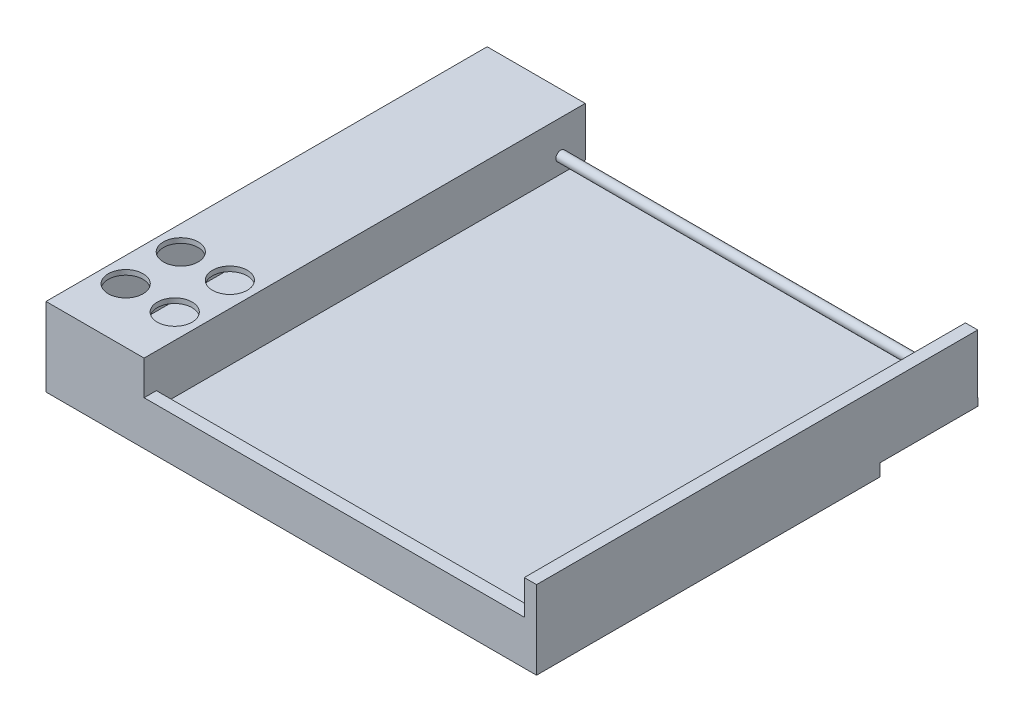
ISO-10303-21;
HEADER;
FILE_DESCRIPTION(('STEP AP214'),'2;1');
FILE_NAME('part.step','',(''),(''),'','','');
FILE_SCHEMA(('AUTOMOTIVE_DESIGN { 1 0 10303 214 1 1 1 1 }'));
ENDSEC;
DATA;
#1=APPLICATION_CONTEXT('core data for automotive mechanical design processes');
#2=APPLICATION_PROTOCOL_DEFINITION('international standard','automotive_design',2000,#1);
#3=PRODUCT_CONTEXT('',#1,'mechanical');
#4=PRODUCT('Part','Part','',(#3));
#5=PRODUCT_RELATED_PRODUCT_CATEGORY('part','',(#4));
#6=PRODUCT_DEFINITION_FORMATION('','',#4);
#7=PRODUCT_DEFINITION_CONTEXT('part definition',#1,'design');
#8=PRODUCT_DEFINITION('design','',#6,#7);
#9=PRODUCT_DEFINITION_SHAPE('','',#8);
#10=(LENGTH_UNIT() NAMED_UNIT(*) SI_UNIT(.MILLI.,.METRE.));
#11=(NAMED_UNIT(*) PLANE_ANGLE_UNIT() SI_UNIT($,.RADIAN.));
#12=(NAMED_UNIT(*) SI_UNIT($,.STERADIAN.) SOLID_ANGLE_UNIT());
#13=UNCERTAINTY_MEASURE_WITH_UNIT(LENGTH_MEASURE(1.E-05),#10,'distance_accuracy_value','');
#14=(GEOMETRIC_REPRESENTATION_CONTEXT(3) GLOBAL_UNCERTAINTY_ASSIGNED_CONTEXT((#13)) GLOBAL_UNIT_ASSIGNED_CONTEXT((#10,
#11,#12)) REPRESENTATION_CONTEXT('',''));
#15=CARTESIAN_POINT('',(0.,0.,0.));
#16=DIRECTION('',(0.,0.,1.));
#17=DIRECTION('',(1.,0.,0.));
#18=AXIS2_PLACEMENT_3D('',#15,#16,#17);
#19=CARTESIAN_POINT('',(0.,3.,0.));
#20=DIRECTION('',(0.,-1.,0.));
#21=DIRECTION('',(0.,0.,-1.));
#22=AXIS2_PLACEMENT_3D('',#19,#20,#21);
#23=PLANE('',#22);
#24=DIRECTION('',(-1.,0.,0.));
#25=VECTOR('',#24,1.);
#26=CARTESIAN_POINT('',(-59.9999999999998,3.,84.9999999999995));
#27=LINE('',#26,#25);
#28=CARTESIAN_POINT('',(95.0000000000002,3.,84.9999999999995));
#29=VERTEX_POINT('',#28);
#30=CARTESIAN_POINT('',(-97.9999999999998,3.,84.9999999999995));
#31=VERTEX_POINT('',#30);
#32=EDGE_CURVE('E323',#29,#31,#27,.T.);
#33=ORIENTED_EDGE('',*,*,#32,.F.);
#34=DIRECTION('',(0.,0.,-1.));
#35=VECTOR('',#34,1.);
#36=CARTESIAN_POINT('',(95.0000000000002,3.,246.847059264749));
#37=LINE('',#36,#35);
#38=CARTESIAN_POINT('',(95.0000000000002,3.,-89.8697054914942));
#39=VERTEX_POINT('',#38);
#40=EDGE_CURVE('E300',#29,#39,#37,.T.);
#41=ORIENTED_EDGE('',*,*,#40,.T.);
#42=DIRECTION('',(-1.,0.,0.));
#43=VECTOR('',#42,1.);
#44=CARTESIAN_POINT('',(-99.9999999999998,3.,-89.8697054914942));
#45=LINE('',#44,#43);
#46=CARTESIAN_POINT('',(100.,3.,-89.8697054914941));
#47=VERTEX_POINT('',#46);
#48=EDGE_CURVE('E203',#47,#39,#45,.T.);
#49=ORIENTED_EDGE('',*,*,#48,.F.);
#50=DIRECTION('',(0.,0.,-1.));
#51=VECTOR('',#50,1.);
#52=CARTESIAN_POINT('',(100.,3.,89.9999999999995));
#53=LINE('',#52,#51);
#54=CARTESIAN_POINT('',(100.,3.,-90.0000000000004));
#55=VERTEX_POINT('',#54);
#56=EDGE_CURVE('E251',#47,#55,#53,.T.);
#57=ORIENTED_EDGE('',*,*,#56,.T.);
#58=DIRECTION('',(-1.,0.,0.));
#59=VECTOR('',#58,1.);
#60=CARTESIAN_POINT('',(-99.9999999999998,3.,-90.0000000000004));
#61=LINE('',#60,#59);
#62=CARTESIAN_POINT('',(-99.9999999999998,3.,-90.0000000000004));
#63=VERTEX_POINT('',#62);
#64=EDGE_CURVE('E254',#55,#63,#61,.T.);
#65=ORIENTED_EDGE('',*,*,#64,.T.);
#66=DIRECTION('',(0.,0.,1.));
#67=VECTOR('',#66,1.);
#68=CARTESIAN_POINT('',(-99.9999999999998,3.,89.9999999999995));
#69=LINE('',#68,#67);
#70=CARTESIAN_POINT('',(-99.9999999999998,3.,-89.8697054914942));
#71=VERTEX_POINT('',#70);
#72=EDGE_CURVE('E200',#63,#71,#69,.T.);
#73=ORIENTED_EDGE('',*,*,#72,.T.);
#74=CARTESIAN_POINT('',(-97.9999999999998,3.,-89.8697054914942));
#75=VERTEX_POINT('',#74);
#76=EDGE_CURVE('E191',#75,#71,#45,.T.);
#77=ORIENTED_EDGE('',*,*,#76,.F.);
#78=DIRECTION('',(0.,0.,-1.));
#79=VECTOR('',#78,1.);
#80=CARTESIAN_POINT('',(-97.9999999999998,3.,133.9089968002));
#81=LINE('',#80,#79);
#82=EDGE_CURVE('E173',#31,#75,#81,.T.);
#83=ORIENTED_EDGE('',*,*,#82,.F.);
#84=EDGE_LOOP('',(#33,#41,#49,#57,#65,#73,#77,#83));
#85=FACE_BOUND('',#84,.T.);
#86=ADVANCED_FACE('F45',(#85),#23,.F.);
#87=CARTESIAN_POINT('',(-59.9999999999998,3.,246.847059264749));
#88=DIRECTION('',(-1.,0.,0.));
#89=DIRECTION('',(0.,0.,1.));
#90=AXIS2_PLACEMENT_3D('',#87,#88,#89);
#91=PLANE('',#90);
#92=CARTESIAN_POINT('',(-59.9999999999998,13.5,-79.8697054914942));
#93=DIRECTION('',(-1.,0.,0.));
#94=DIRECTION('',(0.,0.,1.));
#95=AXIS2_PLACEMENT_3D('',#92,#93,#94);
#96=CIRCLE('',#95,2.);
#97=CARTESIAN_POINT('',(-59.9999999999998,13.5,-77.8697054914942));
#98=VERTEX_POINT('',#97);
#99=EDGE_CURVE('E12',#98,#98,#96,.F.);
#100=ORIENTED_EDGE('',*,*,#99,.F.);
#101=EDGE_LOOP('',(#100));
#102=FACE_BOUND('',#101,.T.);
#103=DIRECTION('',(0.,-1.,0.));
#104=VECTOR('',#103,1.);
#105=CARTESIAN_POINT('',(-59.9999999999998,13.,84.9999999999995));
#106=LINE('',#105,#104);
#107=CARTESIAN_POINT('',(-59.9999999999998,13.,84.9999999999995));
#108=VERTEX_POINT('',#107);
#109=CARTESIAN_POINT('',(-59.9999999999998,7.,84.9999999999995));
#110=VERTEX_POINT('',#109);
#111=EDGE_CURVE('E305',#108,#110,#106,.T.);
#112=ORIENTED_EDGE('',*,*,#111,.T.);
#113=DIRECTION('',(0.,0.,-1.));
#114=VECTOR('',#113,1.);
#115=CARTESIAN_POINT('',(-59.9999999999998,7.,133.9089968002));
#116=LINE('',#115,#114);
#117=CARTESIAN_POINT('',(-59.9999999999998,7.,-89.8697054914942));
#118=VERTEX_POINT('',#117);
#119=EDGE_CURVE('E61',#110,#118,#116,.T.);
#120=ORIENTED_EDGE('',*,*,#119,.T.);
#121=DIRECTION('',(0.,1.,0.));
#122=VECTOR('',#121,1.);
#123=CARTESIAN_POINT('',(-59.9999999999998,3.,-89.8697054914942));
#124=LINE('',#123,#122);
#125=CARTESIAN_POINT('',(-59.9999999999998,27.,-89.8697054914942));
#126=VERTEX_POINT('',#125);
#127=EDGE_CURVE('E304',#118,#126,#124,.T.);
#128=ORIENTED_EDGE('',*,*,#127,.T.);
#129=DIRECTION('',(0.,0.,-1.));
#130=VECTOR('',#129,1.);
#131=CARTESIAN_POINT('',(-59.9999999999998,27.,246.847059264749));
#132=LINE('',#131,#130);
#133=CARTESIAN_POINT('',(-59.9999999999998,27.,89.9999999999995));
#134=VERTEX_POINT('',#133);
#135=EDGE_CURVE('E334',#134,#126,#132,.T.);
#136=ORIENTED_EDGE('',*,*,#135,.F.);
#137=DIRECTION('',(0.,-1.,0.));
#138=VECTOR('',#137,1.);
#139=CARTESIAN_POINT('',(-59.9999999999998,3.,89.9999999999995));
#140=LINE('',#139,#138);
#141=CARTESIAN_POINT('',(-59.9999999999998,13.,89.9999999999995));
#142=VERTEX_POINT('',#141);
#143=EDGE_CURVE('E204',#134,#142,#140,.T.);
#144=ORIENTED_EDGE('',*,*,#143,.T.);
#145=DIRECTION('',(0.,0.,1.));
#146=VECTOR('',#145,1.);
#147=CARTESIAN_POINT('',(-59.9999999999998,13.,89.9999999999995));
#148=LINE('',#147,#146);
#149=EDGE_CURVE('E69',#108,#142,#148,.T.);
#150=ORIENTED_EDGE('',*,*,#149,.F.);
#151=EDGE_LOOP('',(#112,#120,#128,#136,#144,#150));
#152=FACE_BOUND('',#151,.T.);
#153=ADVANCED_FACE('F291',(#102,#152),#91,.F.);
#154=CARTESIAN_POINT('',(95.0000000000002,3.,246.847059264749));
#155=DIRECTION('',(1.,0.,0.));
#156=DIRECTION('',(0.,0.,-1.));
#157=AXIS2_PLACEMENT_3D('',#154,#155,#156);
#158=PLANE('',#157);
#159=CARTESIAN_POINT('',(95.0000000000002,13.5,-79.8697054914942));
#160=DIRECTION('',(1.,0.,0.));
#161=DIRECTION('',(0.,0.,-1.));
#162=AXIS2_PLACEMENT_3D('',#159,#160,#161);
#163=CIRCLE('',#162,2.);
#164=CARTESIAN_POINT('',(95.0000000000002,13.5,-81.8697054914942));
#165=VERTEX_POINT('',#164);
#166=EDGE_CURVE('E54',#165,#165,#163,.F.);
#167=ORIENTED_EDGE('',*,*,#166,.F.);
#168=EDGE_LOOP('',(#167));
#169=FACE_BOUND('',#168,.T.);
#170=DIRECTION('',(0.,-1.,0.));
#171=VECTOR('',#170,1.);
#172=CARTESIAN_POINT('',(95.0000000000002,13.,84.9999999999995));
#173=LINE('',#172,#171);
#174=CARTESIAN_POINT('',(95.0000000000002,13.,84.9999999999995));
#175=VERTEX_POINT('',#174);
#176=EDGE_CURVE('E295',#175,#29,#173,.T.);
#177=ORIENTED_EDGE('',*,*,#176,.F.);
#178=DIRECTION('',(0.,0.,-1.));
#179=VECTOR('',#178,1.);
#180=CARTESIAN_POINT('',(95.0000000000002,13.,89.9999999999995));
#181=LINE('',#180,#179);
#182=CARTESIAN_POINT('',(95.0000000000002,13.,89.9999999999995));
#183=VERTEX_POINT('',#182);
#184=EDGE_CURVE('E297',#183,#175,#181,.T.);
#185=ORIENTED_EDGE('',*,*,#184,.F.);
#186=DIRECTION('',(0.,1.,0.));
#187=VECTOR('',#186,1.);
#188=CARTESIAN_POINT('',(95.0000000000002,3.,89.9999999999995));
#189=LINE('',#188,#187);
#190=CARTESIAN_POINT('',(95.0000000000002,27.,89.9999999999995));
#191=VERTEX_POINT('',#190);
#192=EDGE_CURVE('E210',#183,#191,#189,.T.);
#193=ORIENTED_EDGE('',*,*,#192,.T.);
#194=DIRECTION('',(0.,0.,-1.));
#195=VECTOR('',#194,1.);
#196=CARTESIAN_POINT('',(95.0000000000002,27.,246.847059264749));
#197=LINE('',#196,#195);
#198=CARTESIAN_POINT('',(95.0000000000002,27.,-89.8697054914942));
#199=VERTEX_POINT('',#198);
#200=EDGE_CURVE('E337',#191,#199,#197,.T.);
#201=ORIENTED_EDGE('',*,*,#200,.T.);
#202=DIRECTION('',(0.,-1.,0.));
#203=VECTOR('',#202,1.);
#204=CARTESIAN_POINT('',(95.0000000000002,3.,-89.8697054914942));
#205=LINE('',#204,#203);
#206=EDGE_CURVE('E331',#199,#39,#205,.T.);
#207=ORIENTED_EDGE('',*,*,#206,.T.);
#208=ORIENTED_EDGE('',*,*,#40,.F.);
#209=EDGE_LOOP('',(#177,#185,#193,#201,#207,#208));
#210=FACE_BOUND('',#209,.T.);
#211=ADVANCED_FACE('F288',(#169,#210),#158,.F.);
#212=CARTESIAN_POINT('',(-99.9999999999998,27.,-89.8697054914942));
#213=DIRECTION('',(0.,0.,1.));
#214=DIRECTION('',(1.,0.,0.));
#215=AXIS2_PLACEMENT_3D('',#212,#213,#214);
#216=PLANE('',#215);
#217=ORIENTED_EDGE('',*,*,#127,.F.);
#218=DIRECTION('',(1.,0.,0.));
#219=VECTOR('',#218,1.);
#220=CARTESIAN_POINT('',(-61.9999999999998,7.,-89.8697054914942));
#221=LINE('',#220,#219);
#222=CARTESIAN_POINT('',(-61.9999999999998,7.,-89.8697054914942));
#223=VERTEX_POINT('',#222);
#224=EDGE_CURVE('E185',#223,#118,#221,.T.);
#225=ORIENTED_EDGE('',*,*,#224,.F.);
#226=DIRECTION('',(0.,-1.,0.));
#227=VECTOR('',#226,1.);
#228=CARTESIAN_POINT('',(-61.9999999999998,25.,-89.8697054914942));
#229=LINE('',#228,#227);
#230=CARTESIAN_POINT('',(-61.9999999999998,25.,-89.8697054914942));
#231=VERTEX_POINT('',#230);
#232=EDGE_CURVE('E505',#231,#223,#229,.T.);
#233=ORIENTED_EDGE('',*,*,#232,.F.);
#234=DIRECTION('',(1.,0.,0.));
#235=VECTOR('',#234,1.);
#236=CARTESIAN_POINT('',(-97.9999999999998,25.,-89.8697054914942));
#237=LINE('',#236,#235);
#238=CARTESIAN_POINT('',(-97.9999999999998,25.,-89.8697054914942));
#239=VERTEX_POINT('',#238);
#240=EDGE_CURVE('E195',#239,#231,#237,.T.);
#241=ORIENTED_EDGE('',*,*,#240,.F.);
#242=DIRECTION('',(0.,1.,0.));
#243=VECTOR('',#242,1.);
#244=CARTESIAN_POINT('',(-97.9999999999998,3.,-89.8697054914942));
#245=LINE('',#244,#243);
#246=EDGE_CURVE('E177',#75,#239,#245,.T.);
#247=ORIENTED_EDGE('',*,*,#246,.F.);
#248=ORIENTED_EDGE('',*,*,#76,.T.);
#249=DIRECTION('',(0.,-1.,0.));
#250=VECTOR('',#249,1.);
#251=CARTESIAN_POINT('',(-99.9999999999998,27.,-89.8697054914942));
#252=LINE('',#251,#250);
#253=CARTESIAN_POINT('',(-99.9999999999998,27.,-89.8697054914942));
#254=VERTEX_POINT('',#253);
#255=EDGE_CURVE('E216',#254,#71,#252,.T.);
#256=ORIENTED_EDGE('',*,*,#255,.F.);
#257=DIRECTION('',(-1.,0.,0.));
#258=VECTOR('',#257,1.);
#259=CARTESIAN_POINT('',(-99.9999999999998,27.,-89.8697054914942));
#260=LINE('',#259,#258);
#261=EDGE_CURVE('E352',#126,#254,#260,.T.);
#262=ORIENTED_EDGE('',*,*,#261,.F.);
#263=EDGE_LOOP('',(#217,#225,#233,#241,#247,#248,#256,#262));
#264=FACE_BOUND('',#263,.T.);
#265=ADVANCED_FACE('F189',(#264),#216,.F.);
#266=CARTESIAN_POINT('',(0.,27.,0.));
#267=DIRECTION('',(0.,-1.,0.));
#268=DIRECTION('',(0.,0.,-1.));
#269=AXIS2_PLACEMENT_3D('',#266,#267,#268);
#270=PLANE('',#269);
#271=CARTESIAN_POINT('',(-89.9999999999998,27.,45.0325736271261));
#272=DIRECTION('',(0.,1.,0.));
#273=DIRECTION('',(0.,0.,-1.));
#274=AXIS2_PLACEMENT_3D('',#271,#272,#273);
#275=CIRCLE('',#274,7.1);
#276=CARTESIAN_POINT('',(-89.9999999999998,27.,37.9325736271261));
#277=VERTEX_POINT('',#276);
#278=EDGE_CURVE('E479',#277,#277,#275,.T.);
#279=ORIENTED_EDGE('',*,*,#278,.F.);
#280=EDGE_LOOP('',(#279));
#281=FACE_BOUND('',#280,.T.);
#282=CARTESIAN_POINT('',(-89.9999999999998,27.,67.516286813563));
#283=DIRECTION('',(0.,1.,0.));
#284=DIRECTION('',(0.,0.,-1.));
#285=AXIS2_PLACEMENT_3D('',#282,#283,#284);
#286=CIRCLE('',#285,7.09999999999999);
#287=CARTESIAN_POINT('',(-89.9999999999998,27.,60.416286813563));
#288=VERTEX_POINT('',#287);
#289=EDGE_CURVE('E472',#288,#288,#286,.T.);
#290=ORIENTED_EDGE('',*,*,#289,.F.);
#291=EDGE_LOOP('',(#290));
#292=FACE_BOUND('',#291,.T.);
#293=CARTESIAN_POINT('',(-69.9999999999998,27.,67.516286813563));
#294=DIRECTION('',(0.,1.,0.));
#295=DIRECTION('',(0.,0.,1.));
#296=AXIS2_PLACEMENT_3D('',#293,#294,#295);
#297=CIRCLE('',#296,7.09999999999999);
#298=CARTESIAN_POINT('',(-69.9999999999998,27.,74.616286813563));
#299=VERTEX_POINT('',#298);
#300=EDGE_CURVE('E463',#299,#299,#297,.T.);
#301=ORIENTED_EDGE('',*,*,#300,.F.);
#302=EDGE_LOOP('',(#301));
#303=FACE_BOUND('',#302,.T.);
#304=CARTESIAN_POINT('',(-69.9999999999998,27.,45.0325736271261));
#305=DIRECTION('',(0.,1.,0.));
#306=DIRECTION('',(0.,0.,1.));
#307=AXIS2_PLACEMENT_3D('',#304,#305,#306);
#308=CIRCLE('',#307,7.1);
#309=CARTESIAN_POINT('',(-69.9999999999998,27.,52.1325736271261));
#310=VERTEX_POINT('',#309);
#311=EDGE_CURVE('E466',#310,#310,#308,.T.);
#312=ORIENTED_EDGE('',*,*,#311,.F.);
#313=EDGE_LOOP('',(#312));
#314=FACE_BOUND('',#313,.T.);
#315=DIRECTION('',(1.,0.,0.));
#316=VECTOR('',#315,1.);
#317=CARTESIAN_POINT('',(-99.9999999999998,27.,89.9999999999995));
#318=LINE('',#317,#316);
#319=CARTESIAN_POINT('',(-99.9999999999998,27.,89.9999999999995));
#320=VERTEX_POINT('',#319);
#321=EDGE_CURVE('E347',#320,#134,#318,.T.);
#322=ORIENTED_EDGE('',*,*,#321,.T.);
#323=ORIENTED_EDGE('',*,*,#135,.T.);
#324=ORIENTED_EDGE('',*,*,#261,.T.);
#325=DIRECTION('',(0.,0.,1.));
#326=VECTOR('',#325,1.);
#327=CARTESIAN_POINT('',(-99.9999999999998,27.,89.9999999999995));
#328=LINE('',#327,#326);
#329=EDGE_CURVE('E209',#254,#320,#328,.T.);
#330=ORIENTED_EDGE('',*,*,#329,.T.);
#331=EDGE_LOOP('',(#322,#323,#324,#330));
#332=FACE_BOUND('',#331,.T.);
#333=ADVANCED_FACE('F388',(#281,#292,#303,#314,#332),#270,.F.);
#334=CARTESIAN_POINT('',(100.,3.,89.9999999999995));
#335=DIRECTION('',(-1.,0.,0.));
#336=DIRECTION('',(0.,0.,1.));
#337=AXIS2_PLACEMENT_3D('',#334,#335,#336);
#338=PLANE('',#337);
#339=DIRECTION('',(0.,-1.,0.));
#340=VECTOR('',#339,1.);
#341=CARTESIAN_POINT('',(100.,3.,89.9999999999995));
#342=LINE('',#341,#340);
#343=CARTESIAN_POINT('',(100.,27.,89.9999999999995));
#344=VERTEX_POINT('',#343);
#345=CARTESIAN_POINT('',(100.,-5.,89.9999999999995));
#346=VERTEX_POINT('',#345);
#347=EDGE_CURVE('E260',#344,#346,#342,.T.);
#348=ORIENTED_EDGE('',*,*,#347,.T.);
#349=DIRECTION('',(0.,0.,1.));
#350=VECTOR('',#349,1.);
#351=CARTESIAN_POINT('',(100.,-5.,89.9999999999995));
#352=LINE('',#351,#350);
#353=CARTESIAN_POINT('',(100.,-5.,-50.0000000000005));
#354=VERTEX_POINT('',#353);
#355=EDGE_CURVE('E231',#354,#346,#352,.T.);
#356=ORIENTED_EDGE('',*,*,#355,.F.);
#357=DIRECTION('',(0.,1.,0.));
#358=VECTOR('',#357,1.);
#359=CARTESIAN_POINT('',(100.,-5.,-50.0000000000005));
#360=LINE('',#359,#358);
#361=CARTESIAN_POINT('',(100.,0.,-50.0000000000005));
#362=VERTEX_POINT('',#361);
#363=EDGE_CURVE('E239',#354,#362,#360,.T.);
#364=ORIENTED_EDGE('',*,*,#363,.T.);
#365=DIRECTION('',(0.,0.,-1.));
#366=VECTOR('',#365,1.);
#367=CARTESIAN_POINT('',(100.,0.,89.9999999999995));
#368=LINE('',#367,#366);
#369=CARTESIAN_POINT('',(100.,0.,-90.0000000000004));
#370=VERTEX_POINT('',#369);
#371=EDGE_CURVE('E250',#362,#370,#368,.T.);
#372=ORIENTED_EDGE('',*,*,#371,.T.);
#373=DIRECTION('',(0.,-1.,0.));
#374=VECTOR('',#373,1.);
#375=CARTESIAN_POINT('',(100.,3.,-90.0000000000004));
#376=LINE('',#375,#374);
#377=EDGE_CURVE('E278',#55,#370,#376,.T.);
#378=ORIENTED_EDGE('',*,*,#377,.F.);
#379=ORIENTED_EDGE('',*,*,#56,.F.);
#380=DIRECTION('',(0.,-1.,0.));
#381=VECTOR('',#380,1.);
#382=CARTESIAN_POINT('',(100.,27.,-89.8697054914942));
#383=LINE('',#382,#381);
#384=CARTESIAN_POINT('',(100.,27.,-89.8697054914942));
#385=VERTEX_POINT('',#384);
#386=EDGE_CURVE('E219',#385,#47,#383,.T.);
#387=ORIENTED_EDGE('',*,*,#386,.F.);
#388=DIRECTION('',(0.,0.,-1.));
#389=VECTOR('',#388,1.);
#390=CARTESIAN_POINT('',(100.,27.,89.9999999999995));
#391=LINE('',#390,#389);
#392=EDGE_CURVE('E350',#344,#385,#391,.T.);
#393=ORIENTED_EDGE('',*,*,#392,.F.);
#394=EDGE_LOOP('',(#348,#356,#364,#372,#378,#379,#387,#393));
#395=FACE_BOUND('',#394,.T.);
#396=ADVANCED_FACE('F47',(#395),#338,.F.);
#397=CARTESIAN_POINT('',(-99.9999999999998,3.,-90.0000000000004));
#398=DIRECTION('',(0.,0.,1.));
#399=DIRECTION('',(1.,0.,0.));
#400=AXIS2_PLACEMENT_3D('',#397,#398,#399);
#401=PLANE('',#400);
#402=DIRECTION('',(-1.,0.,0.));
#403=VECTOR('',#402,1.);
#404=CARTESIAN_POINT('',(-99.9999999999998,0.,-90.0000000000004));
#405=LINE('',#404,#403);
#406=CARTESIAN_POINT('',(-99.9999999999998,0.,-90.0000000000004));
#407=VERTEX_POINT('',#406);
#408=EDGE_CURVE('E263',#370,#407,#405,.T.);
#409=ORIENTED_EDGE('',*,*,#408,.T.);
#410=DIRECTION('',(0.,-1.,0.));
#411=VECTOR('',#410,1.);
#412=CARTESIAN_POINT('',(-99.9999999999998,3.,-90.0000000000004));
#413=LINE('',#412,#411);
#414=EDGE_CURVE('E274',#63,#407,#413,.T.);
#415=ORIENTED_EDGE('',*,*,#414,.F.);
#416=ORIENTED_EDGE('',*,*,#64,.F.);
#417=ORIENTED_EDGE('',*,*,#377,.T.);
#418=EDGE_LOOP('',(#409,#415,#416,#417));
#419=FACE_BOUND('',#418,.T.);
#420=ADVANCED_FACE('F381',(#419),#401,.F.);
#421=CARTESIAN_POINT('',(-99.9999999999998,3.,89.9999999999995));
#422=DIRECTION('',(1.,0.,0.));
#423=DIRECTION('',(0.,0.,-1.));
#424=AXIS2_PLACEMENT_3D('',#421,#422,#423);
#425=PLANE('',#424);
#426=DIRECTION('',(0.,0.,1.));
#427=VECTOR('',#426,1.);
#428=CARTESIAN_POINT('',(-99.9999999999998,0.,89.9999999999995));
#429=LINE('',#428,#427);
#430=CARTESIAN_POINT('',(-99.9999999999998,0.,-50.0000000000004));
#431=VERTEX_POINT('',#430);
#432=EDGE_CURVE('E255',#407,#431,#429,.T.);
#433=ORIENTED_EDGE('',*,*,#432,.T.);
#434=DIRECTION('',(0.,1.,0.));
#435=VECTOR('',#434,1.);
#436=CARTESIAN_POINT('',(-99.9999999999998,-5.,-50.0000000000005));
#437=LINE('',#436,#435);
#438=CARTESIAN_POINT('',(-99.9999999999998,-5.,-50.0000000000005));
#439=VERTEX_POINT('',#438);
#440=EDGE_CURVE('E246',#439,#431,#437,.T.);
#441=ORIENTED_EDGE('',*,*,#440,.F.);
#442=DIRECTION('',(0.,0.,-1.));
#443=VECTOR('',#442,1.);
#444=CARTESIAN_POINT('',(-99.9999999999998,-5.,89.9999999999995));
#445=LINE('',#444,#443);
#446=CARTESIAN_POINT('',(-99.9999999999998,-5.,89.9999999999995));
#447=VERTEX_POINT('',#446);
#448=EDGE_CURVE('E224',#447,#439,#445,.T.);
#449=ORIENTED_EDGE('',*,*,#448,.F.);
#450=DIRECTION('',(0.,-1.,0.));
#451=VECTOR('',#450,1.);
#452=CARTESIAN_POINT('',(-99.9999999999998,3.,89.9999999999995));
#453=LINE('',#452,#451);
#454=EDGE_CURVE('E271',#320,#447,#453,.T.);
#455=ORIENTED_EDGE('',*,*,#454,.F.);
#456=ORIENTED_EDGE('',*,*,#329,.F.);
#457=ORIENTED_EDGE('',*,*,#255,.T.);
#458=ORIENTED_EDGE('',*,*,#72,.F.);
#459=ORIENTED_EDGE('',*,*,#414,.T.);
#460=EDGE_LOOP('',(#433,#441,#449,#455,#456,#457,#458,#459));
#461=FACE_BOUND('',#460,.T.);
#462=ADVANCED_FACE('F385',(#461),#425,.F.);
#463=CARTESIAN_POINT('',(-99.9999999999998,3.,89.9999999999995));
#464=DIRECTION('',(0.,0.,-1.));
#465=DIRECTION('',(-1.,0.,0.));
#466=AXIS2_PLACEMENT_3D('',#463,#464,#465);
#467=PLANE('',#466);
#468=DIRECTION('',(1.,0.,0.));
#469=VECTOR('',#468,1.);
#470=CARTESIAN_POINT('',(-59.9999999999998,13.,89.9999999999995));
#471=LINE('',#470,#469);
#472=EDGE_CURVE('E313',#142,#183,#471,.T.);
#473=ORIENTED_EDGE('',*,*,#472,.F.);
#474=ORIENTED_EDGE('',*,*,#143,.F.);
#475=ORIENTED_EDGE('',*,*,#321,.F.);
#476=ORIENTED_EDGE('',*,*,#454,.T.);
#477=DIRECTION('',(-1.,0.,0.));
#478=VECTOR('',#477,1.);
#479=CARTESIAN_POINT('',(-99.9999999999998,-5.,89.9999999999995));
#480=LINE('',#479,#478);
#481=EDGE_CURVE('E235',#346,#447,#480,.T.);
#482=ORIENTED_EDGE('',*,*,#481,.F.);
#483=ORIENTED_EDGE('',*,*,#347,.F.);
#484=EDGE_CURVE('E346',#191,#344,#318,.T.);
#485=ORIENTED_EDGE('',*,*,#484,.F.);
#486=ORIENTED_EDGE('',*,*,#192,.F.);
#487=EDGE_LOOP('',(#473,#474,#475,#476,#482,#483,#485,#486));
#488=FACE_BOUND('',#487,.T.);
#489=ADVANCED_FACE('F369',(#488),#467,.F.);
#490=CARTESIAN_POINT('',(0.,0.,0.));
#491=DIRECTION('',(0.,-1.,0.));
#492=DIRECTION('',(0.,0.,-1.));
#493=AXIS2_PLACEMENT_3D('',#490,#491,#492);
#494=PLANE('',#493);
#495=DIRECTION('',(1.,0.,0.));
#496=VECTOR('',#495,1.);
#497=CARTESIAN_POINT('',(-99.9999999999998,0.,-50.0000000000005));
#498=LINE('',#497,#496);
#499=EDGE_CURVE('E223',#431,#362,#498,.T.);
#500=ORIENTED_EDGE('',*,*,#499,.F.);
#501=ORIENTED_EDGE('',*,*,#432,.F.);
#502=ORIENTED_EDGE('',*,*,#408,.F.);
#503=ORIENTED_EDGE('',*,*,#371,.F.);
#504=EDGE_LOOP('',(#500,#501,#502,#503));
#505=FACE_BOUND('',#504,.T.);
#506=ADVANCED_FACE('F398',(#505),#494,.T.);
#507=CARTESIAN_POINT('',(-99.9999999999998,-5.,-50.0000000000005));
#508=DIRECTION('',(0.,0.,1.));
#509=DIRECTION('',(1.,0.,0.));
#510=AXIS2_PLACEMENT_3D('',#507,#508,#509);
#511=PLANE('',#510);
#512=ORIENTED_EDGE('',*,*,#499,.T.);
#513=ORIENTED_EDGE('',*,*,#363,.F.);
#514=DIRECTION('',(1.,0.,0.));
#515=VECTOR('',#514,1.);
#516=CARTESIAN_POINT('',(-99.9999999999998,-5.,-50.0000000000005));
#517=LINE('',#516,#515);
#518=EDGE_CURVE('E228',#439,#354,#517,.T.);
#519=ORIENTED_EDGE('',*,*,#518,.F.);
#520=ORIENTED_EDGE('',*,*,#440,.T.);
#521=EDGE_LOOP('',(#512,#513,#519,#520));
#522=FACE_BOUND('',#521,.T.);
#523=ADVANCED_FACE('F395',(#522),#511,.F.);
#524=CARTESIAN_POINT('',(0.,-5.,0.));
#525=DIRECTION('',(0.,-1.,0.));
#526=DIRECTION('',(0.,0.,-1.));
#527=AXIS2_PLACEMENT_3D('',#524,#525,#526);
#528=PLANE('',#527);
#529=ORIENTED_EDGE('',*,*,#448,.T.);
#530=ORIENTED_EDGE('',*,*,#518,.T.);
#531=ORIENTED_EDGE('',*,*,#355,.T.);
#532=ORIENTED_EDGE('',*,*,#481,.T.);
#533=EDGE_LOOP('',(#529,#530,#531,#532));
#534=FACE_BOUND('',#533,.T.);
#535=ADVANCED_FACE('F392',(#534),#528,.T.);
#536=ORIENTED_EDGE('',*,*,#48,.T.);
#537=ORIENTED_EDGE('',*,*,#206,.F.);
#538=EDGE_CURVE('E214',#385,#199,#260,.T.);
#539=ORIENTED_EDGE('',*,*,#538,.F.);
#540=ORIENTED_EDGE('',*,*,#386,.T.);
#541=EDGE_LOOP('',(#536,#537,#539,#540));
#542=FACE_BOUND('',#541,.T.);
#543=ADVANCED_FACE('F367',(#542),#216,.F.);
#544=ORIENTED_EDGE('',*,*,#538,.T.);
#545=ORIENTED_EDGE('',*,*,#200,.F.);
#546=ORIENTED_EDGE('',*,*,#484,.T.);
#547=ORIENTED_EDGE('',*,*,#392,.T.);
#548=EDGE_LOOP('',(#544,#545,#546,#547));
#549=FACE_BOUND('',#548,.T.);
#550=ADVANCED_FACE('F363',(#549),#270,.F.);
#551=CARTESIAN_POINT('',(-65.6568542494922,13.5,-79.8697054914942));
#552=DIRECTION('',(1.,0.,0.));
#553=DIRECTION('',(0.,0.,-1.));
#554=AXIS2_PLACEMENT_3D('',#551,#552,#553);
#555=CYLINDRICAL_SURFACE('',#554,2.);
#556=ORIENTED_EDGE('',*,*,#166,.T.);
#557=EDGE_LOOP('',(#556));
#558=FACE_BOUND('',#557,.T.);
#559=ORIENTED_EDGE('',*,*,#99,.T.);
#560=EDGE_LOOP('',(#559));
#561=FACE_BOUND('',#560,.T.);
#562=ADVANCED_FACE('F285',(#558,#561),#555,.T.);
#563=CARTESIAN_POINT('',(-59.9999999999998,13.,84.9999999999995));
#564=DIRECTION('',(0.,0.,1.));
#565=DIRECTION('',(1.,0.,0.));
#566=AXIS2_PLACEMENT_3D('',#563,#564,#565);
#567=PLANE('',#566);
#568=ORIENTED_EDGE('',*,*,#32,.T.);
#569=DIRECTION('',(0.,-1.,0.));
#570=VECTOR('',#569,1.);
#571=CARTESIAN_POINT('',(-97.9999999999998,3.,84.9999999999995));
#572=LINE('',#571,#570);
#573=CARTESIAN_POINT('',(-97.9999999999998,25.,84.9999999999995));
#574=VERTEX_POINT('',#573);
#575=EDGE_CURVE('E180',#574,#31,#572,.T.);
#576=ORIENTED_EDGE('',*,*,#575,.F.);
#577=DIRECTION('',(-1.,0.,0.));
#578=VECTOR('',#577,1.);
#579=CARTESIAN_POINT('',(-97.9999999999998,25.,84.9999999999995));
#580=LINE('',#579,#578);
#581=CARTESIAN_POINT('',(-61.9999999999998,25.,84.9999999999995));
#582=VERTEX_POINT('',#581);
#583=EDGE_CURVE('E495',#582,#574,#580,.T.);
#584=ORIENTED_EDGE('',*,*,#583,.F.);
#585=DIRECTION('',(0.,1.,0.));
#586=VECTOR('',#585,1.);
#587=CARTESIAN_POINT('',(-61.9999999999998,25.,84.9999999999995));
#588=LINE('',#587,#586);
#589=CARTESIAN_POINT('',(-61.9999999999998,7.,84.9999999999995));
#590=VERTEX_POINT('',#589);
#591=EDGE_CURVE('E498',#590,#582,#588,.T.);
#592=ORIENTED_EDGE('',*,*,#591,.F.);
#593=DIRECTION('',(-1.,0.,0.));
#594=VECTOR('',#593,1.);
#595=CARTESIAN_POINT('',(-61.9999999999998,7.,84.9999999999995));
#596=LINE('',#595,#594);
#597=EDGE_CURVE('E325',#110,#590,#596,.T.);
#598=ORIENTED_EDGE('',*,*,#597,.F.);
#599=ORIENTED_EDGE('',*,*,#111,.F.);
#600=DIRECTION('',(-1.,0.,0.));
#601=VECTOR('',#600,1.);
#602=CARTESIAN_POINT('',(-59.9999999999998,13.,84.9999999999995));
#603=LINE('',#602,#601);
#604=EDGE_CURVE('E310',#175,#108,#603,.T.);
#605=ORIENTED_EDGE('',*,*,#604,.F.);
#606=ORIENTED_EDGE('',*,*,#176,.T.);
#607=EDGE_LOOP('',(#568,#576,#584,#592,#598,#599,#605,#606));
#608=FACE_BOUND('',#607,.T.);
#609=ADVANCED_FACE('F316',(#608),#567,.F.);
#610=CARTESIAN_POINT('',(0.,13.,0.));
#611=DIRECTION('',(0.,-1.,0.));
#612=DIRECTION('',(0.,0.,-1.));
#613=AXIS2_PLACEMENT_3D('',#610,#611,#612);
#614=PLANE('',#613);
#615=ORIENTED_EDGE('',*,*,#149,.T.);
#616=ORIENTED_EDGE('',*,*,#472,.T.);
#617=ORIENTED_EDGE('',*,*,#184,.T.);
#618=ORIENTED_EDGE('',*,*,#604,.T.);
#619=EDGE_LOOP('',(#615,#616,#617,#618));
#620=FACE_BOUND('',#619,.T.);
#621=ADVANCED_FACE('F309',(#620),#614,.F.);
#622=CARTESIAN_POINT('',(-61.9999999999998,7.,133.9089968002));
#623=DIRECTION('',(0.,1.,0.));
#624=DIRECTION('',(-1.,0.,0.));
#625=AXIS2_PLACEMENT_3D('',#622,#623,#624);
#626=PLANE('',#625);
#627=ORIENTED_EDGE('',*,*,#597,.T.);
#628=DIRECTION('',(0.,0.,-1.));
#629=VECTOR('',#628,1.);
#630=CARTESIAN_POINT('',(-61.9999999999998,7.,133.9089968002));
#631=LINE('',#630,#629);
#632=EDGE_CURVE('E513',#590,#223,#631,.T.);
#633=ORIENTED_EDGE('',*,*,#632,.T.);
#634=ORIENTED_EDGE('',*,*,#224,.T.);
#635=ORIENTED_EDGE('',*,*,#119,.F.);
#636=EDGE_LOOP('',(#627,#633,#634,#635));
#637=FACE_BOUND('',#636,.T.);
#638=ADVANCED_FACE('F427',(#637),#626,.F.);
#639=CARTESIAN_POINT('',(-61.9999999999998,25.,133.9089968002));
#640=DIRECTION('',(1.,0.,0.));
#641=DIRECTION('',(0.,0.,-1.));
#642=AXIS2_PLACEMENT_3D('',#639,#640,#641);
#643=PLANE('',#642);
#644=ORIENTED_EDGE('',*,*,#591,.T.);
#645=DIRECTION('',(0.,0.,-1.));
#646=VECTOR('',#645,1.);
#647=CARTESIAN_POINT('',(-61.9999999999998,25.,133.9089968002));
#648=LINE('',#647,#646);
#649=EDGE_CURVE('E516',#582,#231,#648,.T.);
#650=ORIENTED_EDGE('',*,*,#649,.T.);
#651=ORIENTED_EDGE('',*,*,#232,.T.);
#652=ORIENTED_EDGE('',*,*,#632,.F.);
#653=EDGE_LOOP('',(#644,#650,#651,#652));
#654=FACE_BOUND('',#653,.T.);
#655=ADVANCED_FACE('F434',(#654),#643,.F.);
#656=CARTESIAN_POINT('',(-97.9999999999998,25.,133.9089968002));
#657=DIRECTION('',(0.,1.,0.));
#658=DIRECTION('',(-1.,0.,0.));
#659=AXIS2_PLACEMENT_3D('',#656,#657,#658);
#660=PLANE('',#659);
#661=CARTESIAN_POINT('',(-89.9999999999998,25.,45.0325736271261));
#662=DIRECTION('',(0.,1.,0.));
#663=DIRECTION('',(-1.,0.,0.));
#664=AXIS2_PLACEMENT_3D('',#661,#662,#663);
#665=CIRCLE('',#664,7.1);
#666=CARTESIAN_POINT('',(-97.0999999999998,25.,45.0325736271261));
#667=VERTEX_POINT('',#666);
#668=EDGE_CURVE('E483',#667,#667,#665,.F.);
#669=ORIENTED_EDGE('',*,*,#668,.F.);
#670=EDGE_LOOP('',(#669));
#671=FACE_BOUND('',#670,.T.);
#672=CARTESIAN_POINT('',(-89.9999999999998,25.,67.516286813563));
#673=DIRECTION('',(0.,1.,0.));
#674=DIRECTION('',(-1.,0.,0.));
#675=AXIS2_PLACEMENT_3D('',#672,#673,#674);
#676=CIRCLE('',#675,7.09999999999999);
#677=CARTESIAN_POINT('',(-97.0999999999998,25.,67.516286813563));
#678=VERTEX_POINT('',#677);
#679=EDGE_CURVE('E475',#678,#678,#676,.F.);
#680=ORIENTED_EDGE('',*,*,#679,.F.);
#681=EDGE_LOOP('',(#680));
#682=FACE_BOUND('',#681,.T.);
#683=CARTESIAN_POINT('',(-69.9999999999998,25.,67.516286813563));
#684=DIRECTION('',(0.,1.,0.));
#685=DIRECTION('',(-1.,0.,0.));
#686=AXIS2_PLACEMENT_3D('',#683,#684,#685);
#687=CIRCLE('',#686,7.09999999999999);
#688=CARTESIAN_POINT('',(-77.0999999999998,25.,67.516286813563));
#689=VERTEX_POINT('',#688);
#690=EDGE_CURVE('E460',#689,#689,#687,.F.);
#691=ORIENTED_EDGE('',*,*,#690,.F.);
#692=EDGE_LOOP('',(#691));
#693=FACE_BOUND('',#692,.T.);
#694=CARTESIAN_POINT('',(-69.9999999999998,25.,45.0325736271261));
#695=DIRECTION('',(0.,1.,0.));
#696=DIRECTION('',(-1.,0.,0.));
#697=AXIS2_PLACEMENT_3D('',#694,#695,#696);
#698=CIRCLE('',#697,7.1);
#699=CARTESIAN_POINT('',(-77.0999999999998,25.,45.0325736271261));
#700=VERTEX_POINT('',#699);
#701=EDGE_CURVE('E197',#700,#700,#698,.F.);
#702=ORIENTED_EDGE('',*,*,#701,.F.);
#703=EDGE_LOOP('',(#702));
#704=FACE_BOUND('',#703,.T.);
#705=ORIENTED_EDGE('',*,*,#583,.T.);
#706=DIRECTION('',(0.,0.,-1.));
#707=VECTOR('',#706,1.);
#708=CARTESIAN_POINT('',(-97.9999999999998,25.,133.9089968002));
#709=LINE('',#708,#707);
#710=EDGE_CURVE('E184',#574,#239,#709,.T.);
#711=ORIENTED_EDGE('',*,*,#710,.T.);
#712=ORIENTED_EDGE('',*,*,#240,.T.);
#713=ORIENTED_EDGE('',*,*,#649,.F.);
#714=EDGE_LOOP('',(#705,#711,#712,#713));
#715=FACE_BOUND('',#714,.T.);
#716=ADVANCED_FACE('F431',(#671,#682,#693,#704,#715),#660,.F.);
#717=CARTESIAN_POINT('',(-97.9999999999998,3.,133.9089968002));
#718=DIRECTION('',(-1.,0.,0.));
#719=DIRECTION('',(0.,0.,1.));
#720=AXIS2_PLACEMENT_3D('',#717,#718,#719);
#721=PLANE('',#720);
#722=ORIENTED_EDGE('',*,*,#575,.T.);
#723=ORIENTED_EDGE('',*,*,#82,.T.);
#724=ORIENTED_EDGE('',*,*,#246,.T.);
#725=ORIENTED_EDGE('',*,*,#710,.F.);
#726=EDGE_LOOP('',(#722,#723,#724,#725));
#727=FACE_BOUND('',#726,.T.);
#728=ADVANCED_FACE('F175',(#727),#721,.F.);
#729=CARTESIAN_POINT('',(-69.9999999999998,4.91816741430206,45.0325736271261));
#730=DIRECTION('',(0.,1.,0.));
#731=DIRECTION('',(0.,0.,1.));
#732=AXIS2_PLACEMENT_3D('',#729,#730,#731);
#733=CYLINDRICAL_SURFACE('',#732,7.1);
#734=ORIENTED_EDGE('',*,*,#701,.T.);
#735=EDGE_LOOP('',(#734));
#736=FACE_BOUND('',#735,.T.);
#737=ORIENTED_EDGE('',*,*,#311,.T.);
#738=EDGE_LOOP('',(#737));
#739=FACE_BOUND('',#738,.T.);
#740=ADVANCED_FACE('F430',(#736,#739),#733,.F.);
#741=CARTESIAN_POINT('',(-69.9999999999998,4.91816741430206,67.516286813563));
#742=DIRECTION('',(0.,1.,0.));
#743=DIRECTION('',(0.,0.,1.));
#744=AXIS2_PLACEMENT_3D('',#741,#742,#743);
#745=CYLINDRICAL_SURFACE('',#744,7.09999999999999);
#746=ORIENTED_EDGE('',*,*,#690,.T.);
#747=EDGE_LOOP('',(#746));
#748=FACE_BOUND('',#747,.T.);
#749=ORIENTED_EDGE('',*,*,#300,.T.);
#750=EDGE_LOOP('',(#749));
#751=FACE_BOUND('',#750,.T.);
#752=ADVANCED_FACE('F443',(#748,#751),#745,.F.);
#753=CARTESIAN_POINT('',(-89.9999999999998,4.91816741430206,67.516286813563));
#754=DIRECTION('',(0.,1.,0.));
#755=DIRECTION('',(0.,0.,1.));
#756=AXIS2_PLACEMENT_3D('',#753,#754,#755);
#757=CYLINDRICAL_SURFACE('',#756,7.09999999999999);
#758=ORIENTED_EDGE('',*,*,#679,.T.);
#759=EDGE_LOOP('',(#758));
#760=FACE_BOUND('',#759,.T.);
#761=ORIENTED_EDGE('',*,*,#289,.T.);
#762=EDGE_LOOP('',(#761));
#763=FACE_BOUND('',#762,.T.);
#764=ADVANCED_FACE('F448',(#760,#763),#757,.F.);
#765=CARTESIAN_POINT('',(-89.9999999999998,4.91816741430206,45.0325736271261));
#766=DIRECTION('',(0.,1.,0.));
#767=DIRECTION('',(0.,0.,1.));
#768=AXIS2_PLACEMENT_3D('',#765,#766,#767);
#769=CYLINDRICAL_SURFACE('',#768,7.1);
#770=ORIENTED_EDGE('',*,*,#668,.T.);
#771=EDGE_LOOP('',(#770));
#772=FACE_BOUND('',#771,.T.);
#773=ORIENTED_EDGE('',*,*,#278,.T.);
#774=EDGE_LOOP('',(#773));
#775=FACE_BOUND('',#774,.T.);
#776=ADVANCED_FACE('F445',(#772,#775),#769,.F.);
#777=CLOSED_SHELL('',(#86,#153,#211,#265,#333,#396,#420,#462,#489,#506,#523,#535,#543,#550,#562,
#609,#621,#638,#655,#716,#728,#740,#752,#764,#776));
#778=MANIFOLD_SOLID_BREP('B2',#777);
#779=ADVANCED_BREP_SHAPE_REPRESENTATION('',(#18,#778),#14);
#780=SHAPE_DEFINITION_REPRESENTATION(#9,#779);
ENDSEC;
END-ISO-10303-21;
